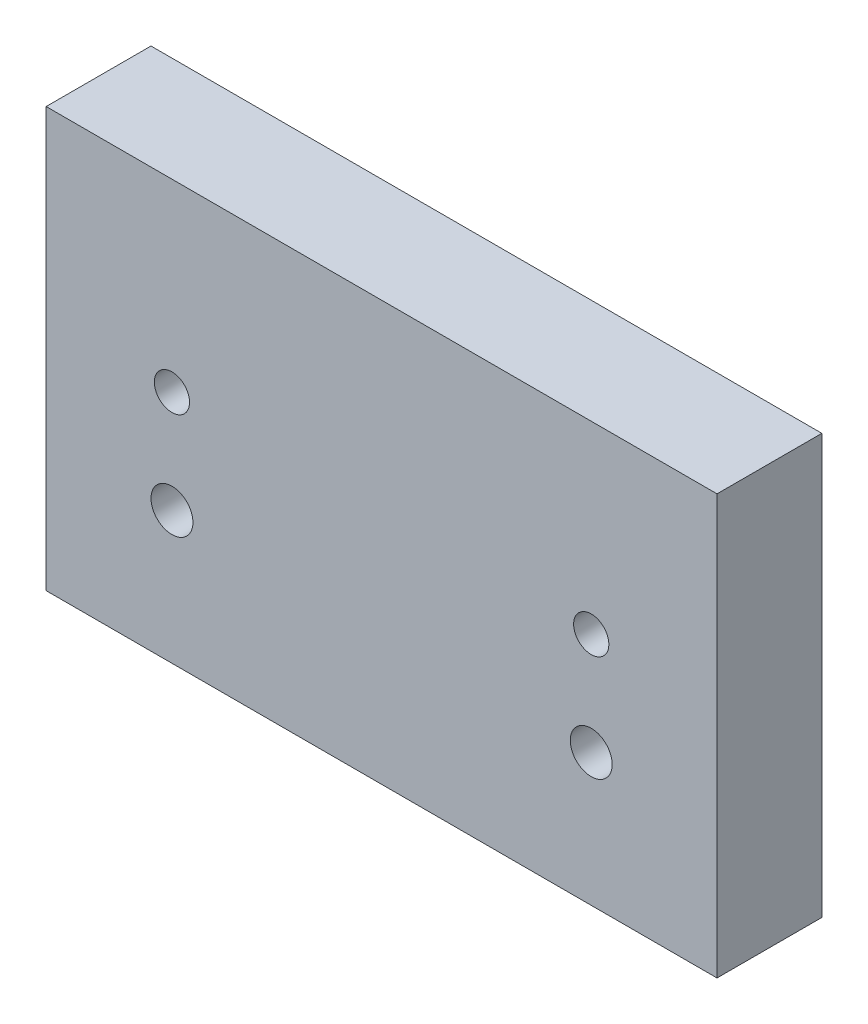
ISO-10303-21;
HEADER;
FILE_DESCRIPTION(('STEP AP214'),'2;1');
FILE_NAME('part.step','',(''),(''),'','','');
FILE_SCHEMA(('AUTOMOTIVE_DESIGN { 1 0 10303 214 1 1 1 1 }'));
ENDSEC;
DATA;
#1=APPLICATION_CONTEXT('core data for automotive mechanical design processes');
#2=APPLICATION_PROTOCOL_DEFINITION('international standard','automotive_design',2000,#1);
#3=PRODUCT_CONTEXT('',#1,'mechanical');
#4=PRODUCT('Part','Part','',(#3));
#5=PRODUCT_RELATED_PRODUCT_CATEGORY('part','',(#4));
#6=PRODUCT_DEFINITION_FORMATION('','',#4);
#7=PRODUCT_DEFINITION_CONTEXT('part definition',#1,'design');
#8=PRODUCT_DEFINITION('design','',#6,#7);
#9=PRODUCT_DEFINITION_SHAPE('','',#8);
#10=(LENGTH_UNIT() NAMED_UNIT(*) SI_UNIT(.MILLI.,.METRE.));
#11=(NAMED_UNIT(*) PLANE_ANGLE_UNIT() SI_UNIT($,.RADIAN.));
#12=(NAMED_UNIT(*) SI_UNIT($,.STERADIAN.) SOLID_ANGLE_UNIT());
#13=UNCERTAINTY_MEASURE_WITH_UNIT(LENGTH_MEASURE(1.E-05),#10,'distance_accuracy_value','');
#14=(GEOMETRIC_REPRESENTATION_CONTEXT(3) GLOBAL_UNCERTAINTY_ASSIGNED_CONTEXT((#13)) GLOBAL_UNIT_ASSIGNED_CONTEXT((#10,
#11,#12)) REPRESENTATION_CONTEXT('',''));
#15=CARTESIAN_POINT('',(0.,0.,0.));
#16=DIRECTION('',(0.,0.,1.));
#17=DIRECTION('',(1.,0.,0.));
#18=AXIS2_PLACEMENT_3D('',#15,#16,#17);
#19=CARTESIAN_POINT('',(40.,25.,12.5));
#20=DIRECTION('',(-1.,0.,0.));
#21=DIRECTION('',(0.,0.,1.));
#22=AXIS2_PLACEMENT_3D('',#19,#20,#21);
#23=PLANE('',#22);
#24=DIRECTION('',(0.,1.,0.));
#25=VECTOR('',#24,1.);
#26=CARTESIAN_POINT('',(40.,25.,0.));
#27=LINE('',#26,#25);
#28=CARTESIAN_POINT('',(40.,-25.,0.));
#29=VERTEX_POINT('',#28);
#30=CARTESIAN_POINT('',(40.,25.,0.));
#31=VERTEX_POINT('',#30);
#32=EDGE_CURVE('E101',#29,#31,#27,.T.);
#33=ORIENTED_EDGE('',*,*,#32,.T.);
#34=DIRECTION('',(0.,0.,-1.));
#35=VECTOR('',#34,1.);
#36=CARTESIAN_POINT('',(40.,25.,12.5));
#37=LINE('',#36,#35);
#38=CARTESIAN_POINT('',(40.,25.,12.5));
#39=VERTEX_POINT('',#38);
#40=EDGE_CURVE('E11',#39,#31,#37,.T.);
#41=ORIENTED_EDGE('',*,*,#40,.F.);
#42=DIRECTION('',(0.,1.,0.));
#43=VECTOR('',#42,1.);
#44=CARTESIAN_POINT('',(40.,25.,12.5));
#45=LINE('',#44,#43);
#46=CARTESIAN_POINT('',(40.,-25.,12.5));
#47=VERTEX_POINT('',#46);
#48=EDGE_CURVE('E89',#47,#39,#45,.T.);
#49=ORIENTED_EDGE('',*,*,#48,.F.);
#50=DIRECTION('',(0.,0.,-1.));
#51=VECTOR('',#50,1.);
#52=CARTESIAN_POINT('',(40.,-25.,12.5));
#53=LINE('',#52,#51);
#54=EDGE_CURVE('E97',#47,#29,#53,.T.);
#55=ORIENTED_EDGE('',*,*,#54,.T.);
#56=EDGE_LOOP('',(#33,#41,#49,#55));
#57=FACE_BOUND('',#56,.T.);
#58=ADVANCED_FACE('F38',(#57),#23,.F.);
#59=CARTESIAN_POINT('',(-40.,25.,12.5));
#60=DIRECTION('',(0.,-1.,0.));
#61=DIRECTION('',(0.,0.,-1.));
#62=AXIS2_PLACEMENT_3D('',#59,#60,#61);
#63=PLANE('',#62);
#64=DIRECTION('',(-1.,0.,0.));
#65=VECTOR('',#64,1.);
#66=CARTESIAN_POINT('',(-40.,25.,0.));
#67=LINE('',#66,#65);
#68=CARTESIAN_POINT('',(-40.,25.,0.));
#69=VERTEX_POINT('',#68);
#70=EDGE_CURVE('E93',#31,#69,#67,.T.);
#71=ORIENTED_EDGE('',*,*,#70,.T.);
#72=DIRECTION('',(0.,0.,-1.));
#73=VECTOR('',#72,1.);
#74=CARTESIAN_POINT('',(-40.,25.,12.5));
#75=LINE('',#74,#73);
#76=CARTESIAN_POINT('',(-40.,25.,12.5));
#77=VERTEX_POINT('',#76);
#78=EDGE_CURVE('E46',#77,#69,#75,.T.);
#79=ORIENTED_EDGE('',*,*,#78,.F.);
#80=DIRECTION('',(-1.,0.,0.));
#81=VECTOR('',#80,1.);
#82=CARTESIAN_POINT('',(-40.,25.,12.5));
#83=LINE('',#82,#81);
#84=EDGE_CURVE('E84',#39,#77,#83,.T.);
#85=ORIENTED_EDGE('',*,*,#84,.F.);
#86=ORIENTED_EDGE('',*,*,#40,.T.);
#87=EDGE_LOOP('',(#71,#79,#85,#86));
#88=FACE_BOUND('',#87,.T.);
#89=ADVANCED_FACE('F92',(#88),#63,.F.);
#90=CARTESIAN_POINT('',(-40.,25.,12.5));
#91=DIRECTION('',(1.,0.,0.));
#92=DIRECTION('',(0.,1.,0.));
#93=AXIS2_PLACEMENT_3D('',#90,#91,#92);
#94=PLANE('',#93);
#95=DIRECTION('',(0.,-1.,0.));
#96=VECTOR('',#95,1.);
#97=CARTESIAN_POINT('',(-40.,25.,0.));
#98=LINE('',#97,#96);
#99=CARTESIAN_POINT('',(-40.,-25.,0.));
#100=VERTEX_POINT('',#99);
#101=EDGE_CURVE('E71',#69,#100,#98,.T.);
#102=ORIENTED_EDGE('',*,*,#101,.T.);
#103=DIRECTION('',(0.,0.,-1.));
#104=VECTOR('',#103,1.);
#105=CARTESIAN_POINT('',(-40.,-25.,12.5));
#106=LINE('',#105,#104);
#107=CARTESIAN_POINT('',(-40.,-25.,12.5));
#108=VERTEX_POINT('',#107);
#109=EDGE_CURVE('E94',#108,#100,#106,.T.);
#110=ORIENTED_EDGE('',*,*,#109,.F.);
#111=DIRECTION('',(0.,-1.,0.));
#112=VECTOR('',#111,1.);
#113=CARTESIAN_POINT('',(-40.,25.,12.5));
#114=LINE('',#113,#112);
#115=EDGE_CURVE('E87',#77,#108,#114,.T.);
#116=ORIENTED_EDGE('',*,*,#115,.F.);
#117=ORIENTED_EDGE('',*,*,#78,.T.);
#118=EDGE_LOOP('',(#102,#110,#116,#117));
#119=FACE_BOUND('',#118,.T.);
#120=ADVANCED_FACE('F95',(#119),#94,.F.);
#121=CARTESIAN_POINT('',(-40.,-25.,12.5));
#122=DIRECTION('',(0.,1.,0.));
#123=DIRECTION('',(0.,0.,1.));
#124=AXIS2_PLACEMENT_3D('',#121,#122,#123);
#125=PLANE('',#124);
#126=DIRECTION('',(1.,0.,0.));
#127=VECTOR('',#126,1.);
#128=CARTESIAN_POINT('',(-40.,-25.,0.));
#129=LINE('',#128,#127);
#130=EDGE_CURVE('E77',#100,#29,#129,.T.);
#131=ORIENTED_EDGE('',*,*,#130,.T.);
#132=ORIENTED_EDGE('',*,*,#54,.F.);
#133=DIRECTION('',(1.,0.,0.));
#134=VECTOR('',#133,1.);
#135=CARTESIAN_POINT('',(-40.,-25.,12.5));
#136=LINE('',#135,#134);
#137=EDGE_CURVE('E54',#108,#47,#136,.T.);
#138=ORIENTED_EDGE('',*,*,#137,.F.);
#139=ORIENTED_EDGE('',*,*,#109,.T.);
#140=EDGE_LOOP('',(#131,#132,#138,#139));
#141=FACE_BOUND('',#140,.T.);
#142=ADVANCED_FACE('F109',(#141),#125,.F.);
#143=CARTESIAN_POINT('',(0.,0.,12.5));
#144=DIRECTION('',(0.,0.,1.));
#145=DIRECTION('',(1.,0.,0.));
#146=AXIS2_PLACEMENT_3D('',#143,#144,#145);
#147=PLANE('',#146);
#148=CARTESIAN_POINT('',(-25.,3.,12.5));
#149=DIRECTION('',(0.,0.,1.));
#150=DIRECTION('',(1.,0.,0.));
#151=AXIS2_PLACEMENT_3D('',#148,#149,#150);
#152=CIRCLE('',#151,2.09999999999999);
#153=CARTESIAN_POINT('',(-22.9,3.,12.5));
#154=VERTEX_POINT('',#153);
#155=EDGE_CURVE('E135',#154,#154,#152,.T.);
#156=ORIENTED_EDGE('',*,*,#155,.F.);
#157=EDGE_LOOP('',(#156));
#158=FACE_BOUND('',#157,.T.);
#159=CARTESIAN_POINT('',(25.,3.,12.5));
#160=DIRECTION('',(0.,0.,1.));
#161=DIRECTION('',(1.,0.,0.));
#162=AXIS2_PLACEMENT_3D('',#159,#160,#161);
#163=CIRCLE('',#162,2.09999999999999);
#164=CARTESIAN_POINT('',(27.1,3.,12.5));
#165=VERTEX_POINT('',#164);
#166=EDGE_CURVE('E129',#165,#165,#163,.T.);
#167=ORIENTED_EDGE('',*,*,#166,.F.);
#168=EDGE_LOOP('',(#167));
#169=FACE_BOUND('',#168,.T.);
#170=CARTESIAN_POINT('',(-24.9999999999999,-9.20625857705163,12.5));
#171=DIRECTION('',(0.,0.,1.));
#172=DIRECTION('',(1.,0.,0.));
#173=AXIS2_PLACEMENT_3D('',#170,#171,#172);
#174=CIRCLE('',#173,2.5);
#175=CARTESIAN_POINT('',(-22.4999999999999,-9.20625857705163,12.5));
#176=VERTEX_POINT('',#175);
#177=EDGE_CURVE('E123',#176,#176,#174,.T.);
#178=ORIENTED_EDGE('',*,*,#177,.F.);
#179=EDGE_LOOP('',(#178));
#180=FACE_BOUND('',#179,.T.);
#181=CARTESIAN_POINT('',(25.0000000000001,-9.20625857705163,12.5));
#182=DIRECTION('',(0.,0.,1.));
#183=DIRECTION('',(1.,0.,0.));
#184=AXIS2_PLACEMENT_3D('',#181,#182,#183);
#185=CIRCLE('',#184,2.5);
#186=CARTESIAN_POINT('',(27.5000000000001,-9.20625857705163,12.5));
#187=VERTEX_POINT('',#186);
#188=EDGE_CURVE('E117',#187,#187,#185,.T.);
#189=ORIENTED_EDGE('',*,*,#188,.F.);
#190=EDGE_LOOP('',(#189));
#191=FACE_BOUND('',#190,.T.);
#192=ORIENTED_EDGE('',*,*,#48,.T.);
#193=ORIENTED_EDGE('',*,*,#84,.T.);
#194=ORIENTED_EDGE('',*,*,#115,.T.);
#195=ORIENTED_EDGE('',*,*,#137,.T.);
#196=EDGE_LOOP('',(#192,#193,#194,#195));
#197=FACE_BOUND('',#196,.T.);
#198=ADVANCED_FACE('F85',(#158,#169,#180,#191,#197),#147,.T.);
#199=CARTESIAN_POINT('',(0.,0.,0.));
#200=DIRECTION('',(0.,0.,1.));
#201=DIRECTION('',(1.,0.,0.));
#202=AXIS2_PLACEMENT_3D('',#199,#200,#201);
#203=PLANE('',#202);
#204=CARTESIAN_POINT('',(-25.,3.,0.));
#205=DIRECTION('',(0.,0.,1.));
#206=DIRECTION('',(1.,0.,0.));
#207=AXIS2_PLACEMENT_3D('',#204,#205,#206);
#208=CIRCLE('',#207,2.09999999999999);
#209=CARTESIAN_POINT('',(-22.9,3.,0.));
#210=VERTEX_POINT('',#209);
#211=EDGE_CURVE('E132',#210,#210,#208,.T.);
#212=ORIENTED_EDGE('',*,*,#211,.T.);
#213=EDGE_LOOP('',(#212));
#214=FACE_BOUND('',#213,.T.);
#215=CARTESIAN_POINT('',(25.,3.,0.));
#216=DIRECTION('',(0.,0.,1.));
#217=DIRECTION('',(1.,0.,0.));
#218=AXIS2_PLACEMENT_3D('',#215,#216,#217);
#219=CIRCLE('',#218,2.09999999999999);
#220=CARTESIAN_POINT('',(27.1,3.,0.));
#221=VERTEX_POINT('',#220);
#222=EDGE_CURVE('E126',#221,#221,#219,.T.);
#223=ORIENTED_EDGE('',*,*,#222,.T.);
#224=EDGE_LOOP('',(#223));
#225=FACE_BOUND('',#224,.T.);
#226=CARTESIAN_POINT('',(-24.9999999999999,-9.20625857705163,0.));
#227=DIRECTION('',(0.,0.,1.));
#228=DIRECTION('',(1.,0.,0.));
#229=AXIS2_PLACEMENT_3D('',#226,#227,#228);
#230=CIRCLE('',#229,2.5);
#231=CARTESIAN_POINT('',(-22.4999999999999,-9.20625857705163,0.));
#232=VERTEX_POINT('',#231);
#233=EDGE_CURVE('E120',#232,#232,#230,.T.);
#234=ORIENTED_EDGE('',*,*,#233,.T.);
#235=EDGE_LOOP('',(#234));
#236=FACE_BOUND('',#235,.T.);
#237=CARTESIAN_POINT('',(25.0000000000001,-9.20625857705163,0.));
#238=DIRECTION('',(0.,0.,1.));
#239=DIRECTION('',(1.,0.,0.));
#240=AXIS2_PLACEMENT_3D('',#237,#238,#239);
#241=CIRCLE('',#240,2.5);
#242=CARTESIAN_POINT('',(27.5000000000001,-9.20625857705163,0.));
#243=VERTEX_POINT('',#242);
#244=EDGE_CURVE('E104',#243,#243,#241,.T.);
#245=ORIENTED_EDGE('',*,*,#244,.T.);
#246=EDGE_LOOP('',(#245));
#247=FACE_BOUND('',#246,.T.);
#248=ORIENTED_EDGE('',*,*,#32,.F.);
#249=ORIENTED_EDGE('',*,*,#130,.F.);
#250=ORIENTED_EDGE('',*,*,#101,.F.);
#251=ORIENTED_EDGE('',*,*,#70,.F.);
#252=EDGE_LOOP('',(#248,#249,#250,#251));
#253=FACE_BOUND('',#252,.T.);
#254=ADVANCED_FACE('F112',(#214,#225,#236,#247,#253),#203,.F.);
#255=CARTESIAN_POINT('',(25.0000000000001,-9.20625857705163,12.5));
#256=DIRECTION('',(0.,0.,1.));
#257=DIRECTION('',(1.,0.,0.));
#258=AXIS2_PLACEMENT_3D('',#255,#256,#257);
#259=CYLINDRICAL_SURFACE('',#258,2.5);
#260=ORIENTED_EDGE('',*,*,#244,.F.);
#261=EDGE_LOOP('',(#260));
#262=FACE_BOUND('',#261,.T.);
#263=ORIENTED_EDGE('',*,*,#188,.T.);
#264=EDGE_LOOP('',(#263));
#265=FACE_BOUND('',#264,.T.);
#266=ADVANCED_FACE('F150',(#262,#265),#259,.F.);
#267=CARTESIAN_POINT('',(-24.9999999999999,-9.20625857705163,12.5));
#268=DIRECTION('',(0.,0.,1.));
#269=DIRECTION('',(1.,0.,0.));
#270=AXIS2_PLACEMENT_3D('',#267,#268,#269);
#271=CYLINDRICAL_SURFACE('',#270,2.5);
#272=ORIENTED_EDGE('',*,*,#233,.F.);
#273=EDGE_LOOP('',(#272));
#274=FACE_BOUND('',#273,.T.);
#275=ORIENTED_EDGE('',*,*,#177,.T.);
#276=EDGE_LOOP('',(#275));
#277=FACE_BOUND('',#276,.T.);
#278=ADVANCED_FACE('F152',(#274,#277),#271,.F.);
#279=CARTESIAN_POINT('',(25.,3.,12.5));
#280=DIRECTION('',(0.,0.,1.));
#281=DIRECTION('',(1.,0.,0.));
#282=AXIS2_PLACEMENT_3D('',#279,#280,#281);
#283=CYLINDRICAL_SURFACE('',#282,2.09999999999999);
#284=ORIENTED_EDGE('',*,*,#222,.F.);
#285=EDGE_LOOP('',(#284));
#286=FACE_BOUND('',#285,.T.);
#287=ORIENTED_EDGE('',*,*,#166,.T.);
#288=EDGE_LOOP('',(#287));
#289=FACE_BOUND('',#288,.T.);
#290=ADVANCED_FACE('F159',(#286,#289),#283,.F.);
#291=CARTESIAN_POINT('',(-25.,3.,12.5));
#292=DIRECTION('',(0.,0.,1.));
#293=DIRECTION('',(1.,0.,0.));
#294=AXIS2_PLACEMENT_3D('',#291,#292,#293);
#295=CYLINDRICAL_SURFACE('',#294,2.09999999999999);
#296=ORIENTED_EDGE('',*,*,#211,.F.);
#297=EDGE_LOOP('',(#296));
#298=FACE_BOUND('',#297,.T.);
#299=ORIENTED_EDGE('',*,*,#155,.T.);
#300=EDGE_LOOP('',(#299));
#301=FACE_BOUND('',#300,.T.);
#302=ADVANCED_FACE('F139',(#298,#301),#295,.F.);
#303=CLOSED_SHELL('',(#58,#89,#120,#142,#198,#254,#266,#278,#290,#302));
#304=MANIFOLD_SOLID_BREP('B2',#303);
#305=ADVANCED_BREP_SHAPE_REPRESENTATION('',(#18,#304),#14);
#306=SHAPE_DEFINITION_REPRESENTATION(#9,#305);
ENDSEC;
END-ISO-10303-21;
